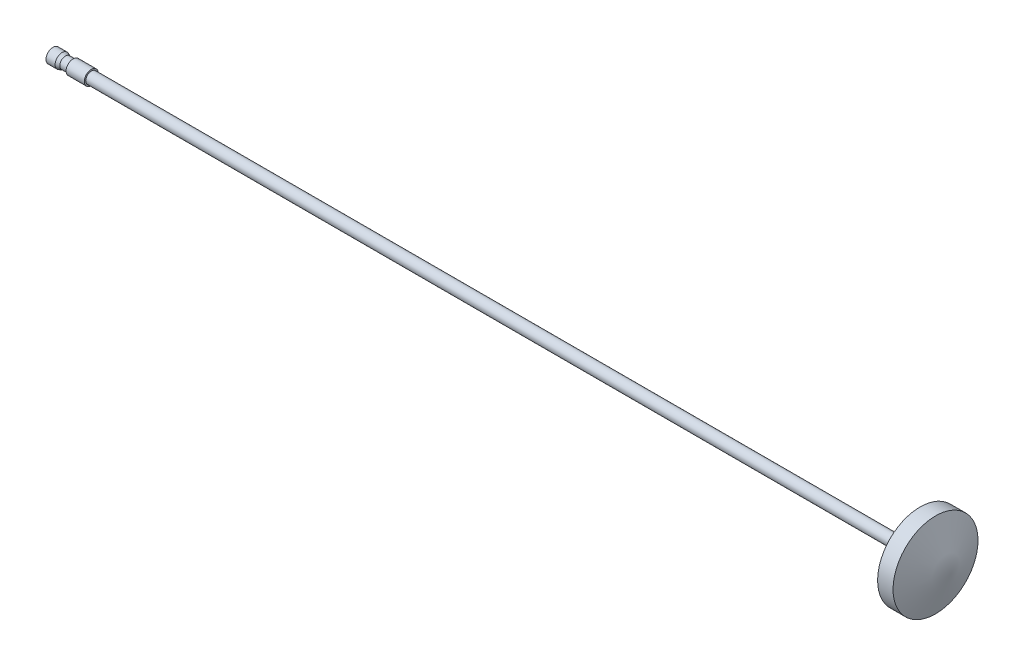
ISO-10303-21;
HEADER;
FILE_DESCRIPTION(('STEP AP214'),'2;1');
FILE_NAME('part.step','',(''),(''),'','','');
FILE_SCHEMA(('AUTOMOTIVE_DESIGN { 1 0 10303 214 1 1 1 1 }'));
ENDSEC;
DATA;
#1=APPLICATION_CONTEXT('core data for automotive mechanical design processes');
#2=APPLICATION_PROTOCOL_DEFINITION('international standard','automotive_design',2000,#1);
#3=PRODUCT_CONTEXT('',#1,'mechanical');
#4=PRODUCT('Part','Part','',(#3));
#5=PRODUCT_RELATED_PRODUCT_CATEGORY('part','',(#4));
#6=PRODUCT_DEFINITION_FORMATION('','',#4);
#7=PRODUCT_DEFINITION_CONTEXT('part definition',#1,'design');
#8=PRODUCT_DEFINITION('design','',#6,#7);
#9=PRODUCT_DEFINITION_SHAPE('','',#8);
#10=(LENGTH_UNIT() NAMED_UNIT(*) SI_UNIT(.MILLI.,.METRE.));
#11=(NAMED_UNIT(*) PLANE_ANGLE_UNIT() SI_UNIT($,.RADIAN.));
#12=(NAMED_UNIT(*) SI_UNIT($,.STERADIAN.) SOLID_ANGLE_UNIT());
#13=UNCERTAINTY_MEASURE_WITH_UNIT(LENGTH_MEASURE(1.E-05),#10,'distance_accuracy_value','');
#14=(GEOMETRIC_REPRESENTATION_CONTEXT(3) GLOBAL_UNCERTAINTY_ASSIGNED_CONTEXT((#13)) GLOBAL_UNIT_ASSIGNED_CONTEXT((#10,
#11,#12)) REPRESENTATION_CONTEXT('',''));
#15=CARTESIAN_POINT('',(0.,0.,0.));
#16=DIRECTION('',(0.,0.,1.));
#17=DIRECTION('',(1.,0.,0.));
#18=AXIS2_PLACEMENT_3D('',#15,#16,#17);
#19=CARTESIAN_POINT('',(-49.42,0.624999999999994,0.));
#20=DIRECTION('',(1.,0.,0.));
#21=DIRECTION('',(0.,1.,0.));
#22=AXIS2_PLACEMENT_3D('',#19,#20,#21);
#23=PLANE('',#22);
#24=CARTESIAN_POINT('',(-49.42,0.,0.));
#25=DIRECTION('',(-1.,0.,0.));
#26=DIRECTION('',(0.,-1.,0.));
#27=AXIS2_PLACEMENT_3D('',#24,#25,#26);
#28=CIRCLE('',#27,0.624999999999994);
#29=CARTESIAN_POINT('',(-49.42,-0.624999999999994,0.));
#30=VERTEX_POINT('',#29);
#31=EDGE_CURVE('E96',#30,#30,#28,.T.);
#32=ORIENTED_EDGE('',*,*,#31,.T.);
#33=EDGE_LOOP('',(#32));
#34=FACE_BOUND('',#33,.T.);
#35=ADVANCED_FACE('F34',(#34),#23,.F.);
#36=CARTESIAN_POINT('',(49.42,0.,0.));
#37=DIRECTION('',(-1.,0.,0.));
#38=DIRECTION('',(0.,-1.,0.));
#39=AXIS2_PLACEMENT_3D('',#36,#37,#38);
#40=CONICAL_SURFACE('',#39,0.,1.22202532321099);
#41=CARTESIAN_POINT('',(47.72,0.,0.));
#42=DIRECTION('',(-1.,0.,0.));
#43=DIRECTION('',(0.,-1.,0.));
#44=AXIS2_PLACEMENT_3D('',#41,#42,#43);
#45=CIRCLE('',#44,4.675);
#46=CARTESIAN_POINT('',(47.72,-4.675,0.));
#47=VERTEX_POINT('',#46);
#48=EDGE_CURVE('E11',#47,#47,#45,.T.);
#49=ORIENTED_EDGE('',*,*,#48,.F.);
#50=EDGE_LOOP('',(#49));
#51=FACE_BOUND('',#50,.T.);
#52=CARTESIAN_POINT('',(49.42,0.,0.));
#53=VERTEX_POINT('',#52);
#54=VERTEX_LOOP('',#53);
#55=FACE_BOUND('',#54,.T.);
#56=ADVANCED_FACE('F43',(#51,#55),#40,.T.);
#57=CARTESIAN_POINT('',(-49.42,0.,0.));
#58=DIRECTION('',(-1.,0.,0.));
#59=DIRECTION('',(0.,-1.,0.));
#60=AXIS2_PLACEMENT_3D('',#57,#58,#59);
#61=CYLINDRICAL_SURFACE('',#60,4.675);
#62=CARTESIAN_POINT('',(46.02,0.,0.));
#63=DIRECTION('',(-1.,0.,0.));
#64=DIRECTION('',(0.,-1.,0.));
#65=AXIS2_PLACEMENT_3D('',#62,#63,#64);
#66=CIRCLE('',#65,4.675);
#67=CARTESIAN_POINT('',(46.02,-4.675,0.));
#68=VERTEX_POINT('',#67);
#69=EDGE_CURVE('E40',#68,#68,#66,.T.);
#70=ORIENTED_EDGE('',*,*,#69,.F.);
#71=EDGE_LOOP('',(#70));
#72=FACE_BOUND('',#71,.T.);
#73=ORIENTED_EDGE('',*,*,#48,.T.);
#74=EDGE_LOOP('',(#73));
#75=FACE_BOUND('',#74,.T.);
#76=ADVANCED_FACE('F45',(#72,#75),#61,.T.);
#77=CARTESIAN_POINT('',(46.02,0.625000000000005,0.));
#78=DIRECTION('',(1.,0.,0.));
#79=DIRECTION('',(0.,1.,0.));
#80=AXIS2_PLACEMENT_3D('',#77,#78,#79);
#81=PLANE('',#80);
#82=CARTESIAN_POINT('',(46.02,0.,0.));
#83=DIRECTION('',(-1.,0.,0.));
#84=DIRECTION('',(0.,-1.,0.));
#85=AXIS2_PLACEMENT_3D('',#82,#83,#84);
#86=CIRCLE('',#85,0.625000000000005);
#87=CARTESIAN_POINT('',(46.02,-0.625000000000005,0.));
#88=VERTEX_POINT('',#87);
#89=EDGE_CURVE('E121',#88,#88,#86,.T.);
#90=ORIENTED_EDGE('',*,*,#89,.F.);
#91=EDGE_LOOP('',(#90));
#92=FACE_BOUND('',#91,.T.);
#93=ORIENTED_EDGE('',*,*,#69,.T.);
#94=EDGE_LOOP('',(#93));
#95=FACE_BOUND('',#94,.T.);
#96=ADVANCED_FACE('F51',(#92,#95),#81,.F.);
#97=CARTESIAN_POINT('',(-49.42,0.,0.));
#98=DIRECTION('',(-1.,0.,0.));
#99=DIRECTION('',(0.,-1.,0.));
#100=AXIS2_PLACEMENT_3D('',#97,#98,#99);
#101=CYLINDRICAL_SURFACE('',#100,0.625);
#102=CARTESIAN_POINT('',(-45.1837534009422,0.,0.));
#103=DIRECTION('',(-1.,0.,0.));
#104=DIRECTION('',(0.,-1.,0.));
#105=AXIS2_PLACEMENT_3D('',#102,#103,#104);
#106=CIRCLE('',#105,0.624999999999994);
#107=CARTESIAN_POINT('',(-45.1837534009422,-0.624999999999994,0.));
#108=VERTEX_POINT('',#107);
#109=EDGE_CURVE('E118',#108,#108,#106,.T.);
#110=ORIENTED_EDGE('',*,*,#109,.F.);
#111=EDGE_LOOP('',(#110));
#112=FACE_BOUND('',#111,.T.);
#113=ORIENTED_EDGE('',*,*,#89,.T.);
#114=EDGE_LOOP('',(#113));
#115=FACE_BOUND('',#114,.T.);
#116=ADVANCED_FACE('F59',(#112,#115),#101,.T.);
#117=CARTESIAN_POINT('',(-45.1837534009422,0.,0.));
#118=DIRECTION('',(-1.,0.,0.));
#119=DIRECTION('',(0.,-1.,0.));
#120=AXIS2_PLACEMENT_3D('',#117,#118,#119);
#121=CONICAL_SURFACE('',#120,0.624999999999994,1.48352986419511);
#122=CARTESIAN_POINT('',(-45.1968767004711,0.,0.));
#123=DIRECTION('',(-1.,0.,0.));
#124=DIRECTION('',(0.,-1.,0.));
#125=AXIS2_PLACEMENT_3D('',#122,#123,#124);
#126=CIRCLE('',#125,0.774999999999994);
#127=CARTESIAN_POINT('',(-45.1968767004711,-0.774999999999994,0.));
#128=VERTEX_POINT('',#127);
#129=EDGE_CURVE('E115',#128,#128,#126,.T.);
#130=ORIENTED_EDGE('',*,*,#129,.F.);
#131=EDGE_LOOP('',(#130));
#132=FACE_BOUND('',#131,.T.);
#133=ORIENTED_EDGE('',*,*,#109,.T.);
#134=EDGE_LOOP('',(#133));
#135=FACE_BOUND('',#134,.T.);
#136=ADVANCED_FACE('F63',(#132,#135),#121,.T.);
#137=CARTESIAN_POINT('',(-49.42,0.,0.));
#138=DIRECTION('',(-1.,0.,0.));
#139=DIRECTION('',(0.,-1.,0.));
#140=AXIS2_PLACEMENT_3D('',#137,#138,#139);
#141=CYLINDRICAL_SURFACE('',#140,0.774999999999994);
#142=CARTESIAN_POINT('',(-47.1968767004711,0.,0.));
#143=DIRECTION('',(-1.,0.,0.));
#144=DIRECTION('',(0.,-1.,0.));
#145=AXIS2_PLACEMENT_3D('',#142,#143,#144);
#146=CIRCLE('',#145,0.774999999999994);
#147=CARTESIAN_POINT('',(-47.1968767004711,-0.774999999999994,0.));
#148=VERTEX_POINT('',#147);
#149=EDGE_CURVE('E112',#148,#148,#146,.T.);
#150=ORIENTED_EDGE('',*,*,#149,.F.);
#151=EDGE_LOOP('',(#150));
#152=FACE_BOUND('',#151,.T.);
#153=ORIENTED_EDGE('',*,*,#129,.T.);
#154=EDGE_LOOP('',(#153));
#155=FACE_BOUND('',#154,.T.);
#156=ADVANCED_FACE('F67',(#152,#155),#141,.T.);
#157=CARTESIAN_POINT('',(-47.1968767004711,0.,0.));
#158=DIRECTION('',(1.,0.,0.));
#159=DIRECTION('',(0.,1.,0.));
#160=AXIS2_PLACEMENT_3D('',#157,#158,#159);
#161=CONICAL_SURFACE('',#160,0.774999999999994,1.48352986419521);
#162=CARTESIAN_POINT('',(-47.21,0.,0.));
#163=DIRECTION('',(-1.,0.,0.));
#164=DIRECTION('',(0.,-1.,0.));
#165=AXIS2_PLACEMENT_3D('',#162,#163,#164);
#166=CIRCLE('',#165,0.624999999999994);
#167=CARTESIAN_POINT('',(-47.21,-0.624999999999994,0.));
#168=VERTEX_POINT('',#167);
#169=EDGE_CURVE('E109',#168,#168,#166,.T.);
#170=ORIENTED_EDGE('',*,*,#169,.F.);
#171=EDGE_LOOP('',(#170));
#172=FACE_BOUND('',#171,.T.);
#173=ORIENTED_EDGE('',*,*,#149,.T.);
#174=EDGE_LOOP('',(#173));
#175=FACE_BOUND('',#174,.T.);
#176=ADVANCED_FACE('F71',(#172,#175),#161,.T.);
#177=CARTESIAN_POINT('',(-49.42,0.,0.));
#178=DIRECTION('',(-1.,0.,0.));
#179=DIRECTION('',(0.,-1.,0.));
#180=AXIS2_PLACEMENT_3D('',#177,#178,#179);
#181=CYLINDRICAL_SURFACE('',#180,0.624999999999994);
#182=CARTESIAN_POINT('',(-48.04,0.,0.));
#183=DIRECTION('',(-1.,0.,0.));
#184=DIRECTION('',(0.,-1.,0.));
#185=AXIS2_PLACEMENT_3D('',#182,#183,#184);
#186=CIRCLE('',#185,0.624999999999994);
#187=CARTESIAN_POINT('',(-48.04,-0.624999999999994,0.));
#188=VERTEX_POINT('',#187);
#189=EDGE_CURVE('E103',#188,#188,#186,.T.);
#190=ORIENTED_EDGE('',*,*,#189,.F.);
#191=EDGE_LOOP('',(#190));
#192=FACE_BOUND('',#191,.T.);
#193=ORIENTED_EDGE('',*,*,#169,.T.);
#194=EDGE_LOOP('',(#193));
#195=FACE_BOUND('',#194,.T.);
#196=ADVANCED_FACE('F75',(#192,#195),#181,.T.);
#197=CARTESIAN_POINT('',(-48.04,0.,0.));
#198=DIRECTION('',(-1.,0.,0.));
#199=DIRECTION('',(0.,-1.,0.));
#200=AXIS2_PLACEMENT_3D('',#197,#198,#199);
#201=CONICAL_SURFACE('',#200,0.624999999999994,0.388118076356517);
#202=CARTESIAN_POINT('',(-48.4068767004711,0.,0.));
#203=DIRECTION('',(-1.,0.,0.));
#204=DIRECTION('',(0.,-1.,0.));
#205=AXIS2_PLACEMENT_3D('',#202,#203,#204);
#206=CIRCLE('',#205,0.774999999999995);
#207=CARTESIAN_POINT('',(-48.4068767004711,-0.774999999999995,0.));
#208=VERTEX_POINT('',#207);
#209=EDGE_CURVE('E100',#208,#208,#206,.T.);
#210=ORIENTED_EDGE('',*,*,#209,.F.);
#211=EDGE_LOOP('',(#210));
#212=FACE_BOUND('',#211,.T.);
#213=ORIENTED_EDGE('',*,*,#189,.T.);
#214=EDGE_LOOP('',(#213));
#215=FACE_BOUND('',#214,.T.);
#216=ADVANCED_FACE('F79',(#212,#215),#201,.T.);
#217=CARTESIAN_POINT('',(-49.42,0.,0.));
#218=DIRECTION('',(-1.,0.,0.));
#219=DIRECTION('',(0.,-1.,0.));
#220=AXIS2_PLACEMENT_3D('',#217,#218,#219);
#221=CYLINDRICAL_SURFACE('',#220,0.774999999999994);
#222=CARTESIAN_POINT('',(-49.4068767004711,0.,0.));
#223=DIRECTION('',(-1.,0.,0.));
#224=DIRECTION('',(0.,-1.,0.));
#225=AXIS2_PLACEMENT_3D('',#222,#223,#224);
#226=CIRCLE('',#225,0.774999999999994);
#227=CARTESIAN_POINT('',(-49.4068767004711,-0.774999999999994,0.));
#228=VERTEX_POINT('',#227);
#229=EDGE_CURVE('E99',#228,#228,#226,.T.);
#230=ORIENTED_EDGE('',*,*,#229,.F.);
#231=EDGE_LOOP('',(#230));
#232=FACE_BOUND('',#231,.T.);
#233=ORIENTED_EDGE('',*,*,#209,.T.);
#234=EDGE_LOOP('',(#233));
#235=FACE_BOUND('',#234,.T.);
#236=ADVANCED_FACE('F83',(#232,#235),#221,.T.);
#237=CARTESIAN_POINT('',(-49.4068767004711,0.,0.));
#238=DIRECTION('',(1.,0.,0.));
#239=DIRECTION('',(0.,1.,0.));
#240=AXIS2_PLACEMENT_3D('',#237,#238,#239);
#241=CONICAL_SURFACE('',#240,0.774999999999994,1.48352986419521);
#242=ORIENTED_EDGE('',*,*,#31,.F.);
#243=EDGE_LOOP('',(#242));
#244=FACE_BOUND('',#243,.T.);
#245=ORIENTED_EDGE('',*,*,#229,.T.);
#246=EDGE_LOOP('',(#245));
#247=FACE_BOUND('',#246,.T.);
#248=ADVANCED_FACE('F87',(#244,#247),#241,.T.);
#249=CLOSED_SHELL('',(#35,#56,#76,#96,#116,#136,#156,#176,#196,#216,#236,#248));
#250=MANIFOLD_SOLID_BREP('B2',#249);
#251=ADVANCED_BREP_SHAPE_REPRESENTATION('',(#18,#250),#14);
#252=SHAPE_DEFINITION_REPRESENTATION(#9,#251);
ENDSEC;
END-ISO-10303-21;
